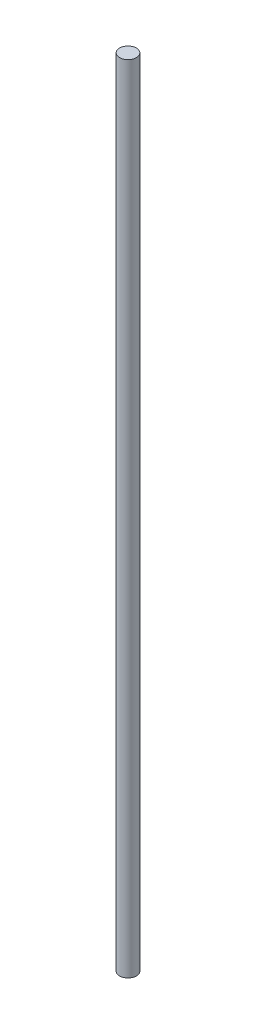
ISO-10303-21;
HEADER;
FILE_DESCRIPTION(('STEP AP214'),'2;1');
FILE_NAME('part.step','',(''),(''),'','','');
FILE_SCHEMA(('AUTOMOTIVE_DESIGN { 1 0 10303 214 1 1 1 1 }'));
ENDSEC;
DATA;
#1=APPLICATION_CONTEXT('core data for automotive mechanical design processes');
#2=APPLICATION_PROTOCOL_DEFINITION('international standard','automotive_design',2000,#1);
#3=PRODUCT_CONTEXT('',#1,'mechanical');
#4=PRODUCT('Part','Part','',(#3));
#5=PRODUCT_RELATED_PRODUCT_CATEGORY('part','',(#4));
#6=PRODUCT_DEFINITION_FORMATION('','',#4);
#7=PRODUCT_DEFINITION_CONTEXT('part definition',#1,'design');
#8=PRODUCT_DEFINITION('design','',#6,#7);
#9=PRODUCT_DEFINITION_SHAPE('','',#8);
#10=(LENGTH_UNIT() NAMED_UNIT(*) SI_UNIT(.MILLI.,.METRE.));
#11=(NAMED_UNIT(*) PLANE_ANGLE_UNIT() SI_UNIT($,.RADIAN.));
#12=(NAMED_UNIT(*) SI_UNIT($,.STERADIAN.) SOLID_ANGLE_UNIT());
#13=UNCERTAINTY_MEASURE_WITH_UNIT(LENGTH_MEASURE(1.E-05),#10,'distance_accuracy_value','');
#14=(GEOMETRIC_REPRESENTATION_CONTEXT(3) GLOBAL_UNCERTAINTY_ASSIGNED_CONTEXT((#13)) GLOBAL_UNIT_ASSIGNED_CONTEXT((#10,
#11,#12)) REPRESENTATION_CONTEXT('',''));
#15=CARTESIAN_POINT('',(0.,0.,0.));
#16=DIRECTION('',(0.,0.,1.));
#17=DIRECTION('',(1.,0.,0.));
#18=AXIS2_PLACEMENT_3D('',#15,#16,#17);
#19=CARTESIAN_POINT('',(0.,380.,0.));
#20=DIRECTION('',(0.,-1.,0.));
#21=DIRECTION('',(0.,0.,-1.));
#22=AXIS2_PLACEMENT_3D('',#19,#20,#21);
#23=CYLINDRICAL_SURFACE('',#22,4.);
#24=CARTESIAN_POINT('',(0.,380.,0.));
#25=DIRECTION('',(0.,1.,0.));
#26=DIRECTION('',(0.,0.,1.));
#27=AXIS2_PLACEMENT_3D('',#24,#25,#26);
#28=CIRCLE('',#27,4.);
#29=CARTESIAN_POINT('',(0.,380.,4.));
#30=VERTEX_POINT('',#29);
#31=EDGE_CURVE('E10',#30,#30,#28,.T.);
#32=ORIENTED_EDGE('',*,*,#31,.F.);
#33=EDGE_LOOP('',(#32));
#34=FACE_BOUND('',#33,.T.);
#35=CARTESIAN_POINT('',(0.,0.,0.));
#36=DIRECTION('',(0.,1.,0.));
#37=DIRECTION('',(0.,0.,1.));
#38=AXIS2_PLACEMENT_3D('',#35,#36,#37);
#39=CIRCLE('',#38,4.);
#40=CARTESIAN_POINT('',(0.,0.,4.));
#41=VERTEX_POINT('',#40);
#42=EDGE_CURVE('E37',#41,#41,#39,.T.);
#43=ORIENTED_EDGE('',*,*,#42,.T.);
#44=EDGE_LOOP('',(#43));
#45=FACE_BOUND('',#44,.T.);
#46=ADVANCED_FACE('F34',(#34,#45),#23,.T.);
#47=CARTESIAN_POINT('',(0.,380.,0.));
#48=DIRECTION('',(0.,1.,0.));
#49=DIRECTION('',(0.,0.,1.));
#50=AXIS2_PLACEMENT_3D('',#47,#48,#49);
#51=PLANE('',#50);
#52=ORIENTED_EDGE('',*,*,#31,.T.);
#53=EDGE_LOOP('',(#52));
#54=FACE_BOUND('',#53,.T.);
#55=ADVANCED_FACE('F49',(#54),#51,.T.);
#56=CARTESIAN_POINT('',(0.,0.,0.));
#57=DIRECTION('',(0.,1.,0.));
#58=DIRECTION('',(0.,0.,1.));
#59=AXIS2_PLACEMENT_3D('',#56,#57,#58);
#60=PLANE('',#59);
#61=ORIENTED_EDGE('',*,*,#42,.F.);
#62=EDGE_LOOP('',(#61));
#63=FACE_BOUND('',#62,.T.);
#64=ADVANCED_FACE('F47',(#63),#60,.F.);
#65=CLOSED_SHELL('',(#46,#55,#64));
#66=MANIFOLD_SOLID_BREP('B2',#65);
#67=ADVANCED_BREP_SHAPE_REPRESENTATION('',(#18,#66),#14);
#68=SHAPE_DEFINITION_REPRESENTATION(#9,#67);
ENDSEC;
END-ISO-10303-21;
